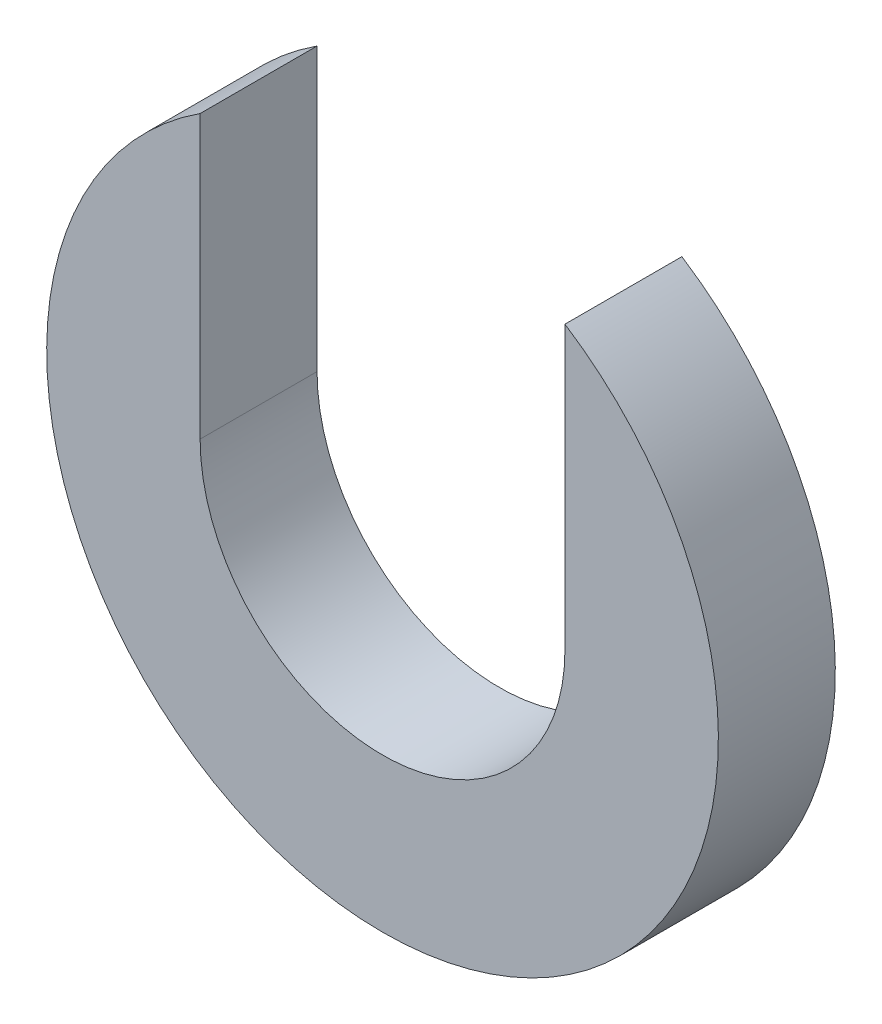
ISO-10303-21;
HEADER;
FILE_DESCRIPTION(('STEP AP214'),'2;1');
FILE_NAME('part.step','',(''),(''),'','','');
FILE_SCHEMA(('AUTOMOTIVE_DESIGN { 1 0 10303 214 1 1 1 1 }'));
ENDSEC;
DATA;
#1=APPLICATION_CONTEXT('core data for automotive mechanical design processes');
#2=APPLICATION_PROTOCOL_DEFINITION('international standard','automotive_design',2000,#1);
#3=PRODUCT_CONTEXT('',#1,'mechanical');
#4=PRODUCT('Part','Part','',(#3));
#5=PRODUCT_RELATED_PRODUCT_CATEGORY('part','',(#4));
#6=PRODUCT_DEFINITION_FORMATION('','',#4);
#7=PRODUCT_DEFINITION_CONTEXT('part definition',#1,'design');
#8=PRODUCT_DEFINITION('design','',#6,#7);
#9=PRODUCT_DEFINITION_SHAPE('','',#8);
#10=(LENGTH_UNIT() NAMED_UNIT(*) SI_UNIT(.MILLI.,.METRE.));
#11=(NAMED_UNIT(*) PLANE_ANGLE_UNIT() SI_UNIT($,.RADIAN.));
#12=(NAMED_UNIT(*) SI_UNIT($,.STERADIAN.) SOLID_ANGLE_UNIT());
#13=UNCERTAINTY_MEASURE_WITH_UNIT(LENGTH_MEASURE(1.E-05),#10,'distance_accuracy_value','');
#14=(GEOMETRIC_REPRESENTATION_CONTEXT(3) GLOBAL_UNCERTAINTY_ASSIGNED_CONTEXT((#13)) GLOBAL_UNIT_ASSIGNED_CONTEXT((#10,
#11,#12)) REPRESENTATION_CONTEXT('',''));
#15=CARTESIAN_POINT('',(0.,0.,0.));
#16=DIRECTION('',(0.,0.,1.));
#17=DIRECTION('',(1.,0.,0.));
#18=AXIS2_PLACEMENT_3D('',#15,#16,#17);
#19=CARTESIAN_POINT('',(0.,0.,3.175));
#20=DIRECTION('',(0.,0.,-1.));
#21=DIRECTION('',(-1.,0.,0.));
#22=AXIS2_PLACEMENT_3D('',#19,#20,#21);
#23=CYLINDRICAL_SURFACE('',#22,4.953);
#24=CARTESIAN_POINT('',(0.,0.,0.));
#25=DIRECTION('',(0.,0.,-1.));
#26=DIRECTION('',(1.,0.,0.));
#27=AXIS2_PLACEMENT_3D('',#24,#25,#26);
#28=CIRCLE('',#27,4.953);
#29=CARTESIAN_POINT('',(4.953,0.,0.));
#30=VERTEX_POINT('',#29);
#31=CARTESIAN_POINT('',(-4.953,0.,0.));
#32=VERTEX_POINT('',#31);
#33=EDGE_CURVE('E107',#30,#32,#28,.T.);
#34=ORIENTED_EDGE('',*,*,#33,.T.);
#35=DIRECTION('',(0.,0.,-1.));
#36=VECTOR('',#35,1.);
#37=CARTESIAN_POINT('',(-4.953,0.,3.175));
#38=LINE('',#37,#36);
#39=CARTESIAN_POINT('',(-4.953,0.,3.175));
#40=VERTEX_POINT('',#39);
#41=EDGE_CURVE('E11',#40,#32,#38,.T.);
#42=ORIENTED_EDGE('',*,*,#41,.F.);
#43=CARTESIAN_POINT('',(0.,0.,3.175));
#44=DIRECTION('',(0.,0.,-1.));
#45=DIRECTION('',(1.,0.,0.));
#46=AXIS2_PLACEMENT_3D('',#43,#44,#45);
#47=CIRCLE('',#46,4.953);
#48=CARTESIAN_POINT('',(4.953,0.,3.175));
#49=VERTEX_POINT('',#48);
#50=EDGE_CURVE('E91',#49,#40,#47,.T.);
#51=ORIENTED_EDGE('',*,*,#50,.F.);
#52=DIRECTION('',(0.,0.,-1.));
#53=VECTOR('',#52,1.);
#54=CARTESIAN_POINT('',(4.953,0.,3.175));
#55=LINE('',#54,#53);
#56=EDGE_CURVE('E103',#49,#30,#55,.T.);
#57=ORIENTED_EDGE('',*,*,#56,.T.);
#58=EDGE_LOOP('',(#34,#42,#51,#57));
#59=FACE_BOUND('',#58,.T.);
#60=ADVANCED_FACE('F39',(#59),#23,.F.);
#61=CARTESIAN_POINT('',(-4.953,0.,3.175));
#62=DIRECTION('',(-1.,0.,0.));
#63=DIRECTION('',(0.,0.,1.));
#64=AXIS2_PLACEMENT_3D('',#61,#62,#63);
#65=PLANE('',#64);
#66=DIRECTION('',(0.,1.,0.));
#67=VECTOR('',#66,1.);
#68=CARTESIAN_POINT('',(-4.953,0.,0.));
#69=LINE('',#68,#67);
#70=CARTESIAN_POINT('',(-4.953,7.65615157634696,0.));
#71=VERTEX_POINT('',#70);
#72=EDGE_CURVE('E96',#32,#71,#69,.T.);
#73=ORIENTED_EDGE('',*,*,#72,.T.);
#74=DIRECTION('',(0.,0.,-1.));
#75=VECTOR('',#74,1.);
#76=CARTESIAN_POINT('',(-4.953,7.65615157634696,3.175));
#77=LINE('',#76,#75);
#78=CARTESIAN_POINT('',(-4.953,7.65615157634696,3.175));
#79=VERTEX_POINT('',#78);
#80=EDGE_CURVE('E48',#79,#71,#77,.T.);
#81=ORIENTED_EDGE('',*,*,#80,.F.);
#82=DIRECTION('',(0.,1.,0.));
#83=VECTOR('',#82,1.);
#84=CARTESIAN_POINT('',(-4.953,0.,3.175));
#85=LINE('',#84,#83);
#86=EDGE_CURVE('E86',#40,#79,#85,.T.);
#87=ORIENTED_EDGE('',*,*,#86,.F.);
#88=ORIENTED_EDGE('',*,*,#41,.T.);
#89=EDGE_LOOP('',(#73,#81,#87,#88));
#90=FACE_BOUND('',#89,.T.);
#91=ADVANCED_FACE('F95',(#90),#65,.F.);
#92=CARTESIAN_POINT('',(0.,0.,3.175));
#93=DIRECTION('',(0.,0.,-1.));
#94=DIRECTION('',(-1.,0.,0.));
#95=AXIS2_PLACEMENT_3D('',#92,#93,#94);
#96=CYLINDRICAL_SURFACE('',#95,9.1186);
#97=CARTESIAN_POINT('',(0.,0.,0.));
#98=DIRECTION('',(0.,0.,1.));
#99=DIRECTION('',(1.,0.,0.));
#100=AXIS2_PLACEMENT_3D('',#97,#98,#99);
#101=CIRCLE('',#100,9.1186);
#102=CARTESIAN_POINT('',(4.953,7.65615157634696,0.));
#103=VERTEX_POINT('',#102);
#104=EDGE_CURVE('E73',#71,#103,#101,.T.);
#105=ORIENTED_EDGE('',*,*,#104,.T.);
#106=DIRECTION('',(0.,0.,-1.));
#107=VECTOR('',#106,1.);
#108=CARTESIAN_POINT('',(4.953,7.65615157634696,3.175));
#109=LINE('',#108,#107);
#110=CARTESIAN_POINT('',(4.953,7.65615157634696,3.175));
#111=VERTEX_POINT('',#110);
#112=EDGE_CURVE('E98',#111,#103,#109,.T.);
#113=ORIENTED_EDGE('',*,*,#112,.F.);
#114=CARTESIAN_POINT('',(0.,0.,3.175));
#115=DIRECTION('',(0.,0.,1.));
#116=DIRECTION('',(1.,0.,0.));
#117=AXIS2_PLACEMENT_3D('',#114,#115,#116);
#118=CIRCLE('',#117,9.1186);
#119=EDGE_CURVE('E89',#79,#111,#118,.T.);
#120=ORIENTED_EDGE('',*,*,#119,.F.);
#121=ORIENTED_EDGE('',*,*,#80,.T.);
#122=EDGE_LOOP('',(#105,#113,#120,#121));
#123=FACE_BOUND('',#122,.T.);
#124=ADVANCED_FACE('F99',(#123),#96,.T.);
#125=CARTESIAN_POINT('',(4.953,0.,3.175));
#126=DIRECTION('',(1.,0.,0.));
#127=DIRECTION('',(0.,0.,-1.));
#128=AXIS2_PLACEMENT_3D('',#125,#126,#127);
#129=PLANE('',#128);
#130=DIRECTION('',(0.,-1.,0.));
#131=VECTOR('',#130,1.);
#132=CARTESIAN_POINT('',(4.953,0.,0.));
#133=LINE('',#132,#131);
#134=EDGE_CURVE('E79',#103,#30,#133,.T.);
#135=ORIENTED_EDGE('',*,*,#134,.T.);
#136=ORIENTED_EDGE('',*,*,#56,.F.);
#137=DIRECTION('',(0.,-1.,0.));
#138=VECTOR('',#137,1.);
#139=CARTESIAN_POINT('',(4.953,0.,3.175));
#140=LINE('',#139,#138);
#141=EDGE_CURVE('E56',#111,#49,#140,.T.);
#142=ORIENTED_EDGE('',*,*,#141,.F.);
#143=ORIENTED_EDGE('',*,*,#112,.T.);
#144=EDGE_LOOP('',(#135,#136,#142,#143));
#145=FACE_BOUND('',#144,.T.);
#146=ADVANCED_FACE('F120',(#145),#129,.F.);
#147=CARTESIAN_POINT('',(0.,0.,3.175));
#148=DIRECTION('',(0.,0.,1.));
#149=DIRECTION('',(1.,0.,0.));
#150=AXIS2_PLACEMENT_3D('',#147,#148,#149);
#151=PLANE('',#150);
#152=ORIENTED_EDGE('',*,*,#50,.T.);
#153=ORIENTED_EDGE('',*,*,#86,.T.);
#154=ORIENTED_EDGE('',*,*,#119,.T.);
#155=ORIENTED_EDGE('',*,*,#141,.T.);
#156=EDGE_LOOP('',(#152,#153,#154,#155));
#157=FACE_BOUND('',#156,.T.);
#158=ADVANCED_FACE('F87',(#157),#151,.T.);
#159=CARTESIAN_POINT('',(0.,0.,0.));
#160=DIRECTION('',(0.,0.,1.));
#161=DIRECTION('',(1.,0.,0.));
#162=AXIS2_PLACEMENT_3D('',#159,#160,#161);
#163=PLANE('',#162);
#164=ORIENTED_EDGE('',*,*,#33,.F.);
#165=ORIENTED_EDGE('',*,*,#134,.F.);
#166=ORIENTED_EDGE('',*,*,#104,.F.);
#167=ORIENTED_EDGE('',*,*,#72,.F.);
#168=EDGE_LOOP('',(#164,#165,#166,#167));
#169=FACE_BOUND('',#168,.T.);
#170=ADVANCED_FACE('F123',(#169),#163,.F.);
#171=CLOSED_SHELL('',(#60,#91,#124,#146,#158,#170));
#172=MANIFOLD_SOLID_BREP('B2',#171);
#173=ADVANCED_BREP_SHAPE_REPRESENTATION('',(#18,#172),#14);
#174=SHAPE_DEFINITION_REPRESENTATION(#9,#173);
ENDSEC;
END-ISO-10303-21;
